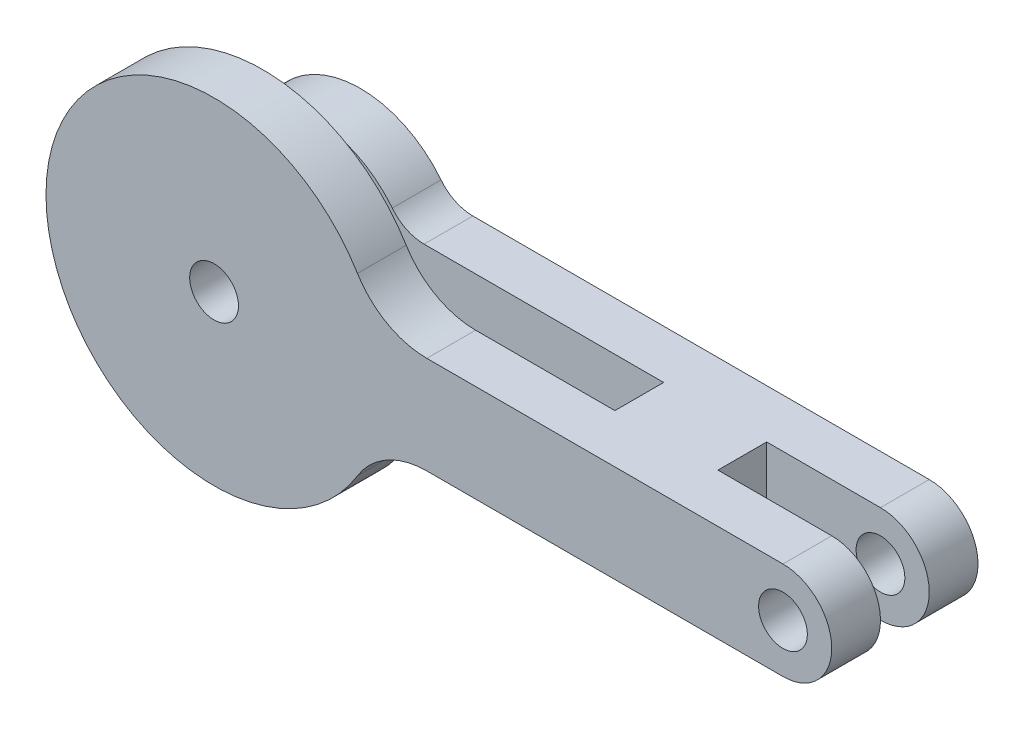
ISO-10303-21;
HEADER;
FILE_DESCRIPTION(('STEP AP214'),'2;1');
FILE_NAME('part.step','',(''),(''),'','','');
FILE_SCHEMA(('AUTOMOTIVE_DESIGN { 1 0 10303 214 1 1 1 1 }'));
ENDSEC;
DATA;
#1=APPLICATION_CONTEXT('core data for automotive mechanical design processes');
#2=APPLICATION_PROTOCOL_DEFINITION('international standard','automotive_design',2000,#1);
#3=PRODUCT_CONTEXT('',#1,'mechanical');
#4=PRODUCT('Part','Part','',(#3));
#5=PRODUCT_RELATED_PRODUCT_CATEGORY('part','',(#4));
#6=PRODUCT_DEFINITION_FORMATION('','',#4);
#7=PRODUCT_DEFINITION_CONTEXT('part definition',#1,'design');
#8=PRODUCT_DEFINITION('design','',#6,#7);
#9=PRODUCT_DEFINITION_SHAPE('','',#8);
#10=(LENGTH_UNIT() NAMED_UNIT(*) SI_UNIT(.MILLI.,.METRE.));
#11=(NAMED_UNIT(*) PLANE_ANGLE_UNIT() SI_UNIT($,.RADIAN.));
#12=(NAMED_UNIT(*) SI_UNIT($,.STERADIAN.) SOLID_ANGLE_UNIT());
#13=UNCERTAINTY_MEASURE_WITH_UNIT(LENGTH_MEASURE(1.E-05),#10,'distance_accuracy_value','');
#14=(GEOMETRIC_REPRESENTATION_CONTEXT(3) GLOBAL_UNCERTAINTY_ASSIGNED_CONTEXT((#13)) GLOBAL_UNIT_ASSIGNED_CONTEXT((#10,
#11,#12)) REPRESENTATION_CONTEXT('',''));
#15=CARTESIAN_POINT('',(0.,0.,0.));
#16=DIRECTION('',(0.,0.,1.));
#17=DIRECTION('',(1.,0.,0.));
#18=AXIS2_PLACEMENT_3D('',#15,#16,#17);
#19=CARTESIAN_POINT('',(0.,0.,-4.5));
#20=DIRECTION('',(0.,0.,1.));
#21=DIRECTION('',(1.,0.,0.));
#22=AXIS2_PLACEMENT_3D('',#19,#20,#21);
#23=PLANE('',#22);
#24=CARTESIAN_POINT('',(0.,0.,-4.5));
#25=DIRECTION('',(0.,0.,1.));
#26=DIRECTION('',(1.,0.,0.));
#27=AXIS2_PLACEMENT_3D('',#24,#25,#26);
#28=CIRCLE('',#27,1.5);
#29=CARTESIAN_POINT('',(1.5,0.,-4.5));
#30=VERTEX_POINT('',#29);
#31=EDGE_CURVE('E245',#30,#30,#28,.T.);
#32=ORIENTED_EDGE('',*,*,#31,.T.);
#33=EDGE_LOOP('',(#32));
#34=FACE_BOUND('',#33,.T.);
#35=CARTESIAN_POINT('',(35.,0.,-4.5));
#36=DIRECTION('',(0.,0.,1.));
#37=DIRECTION('',(1.,0.,0.));
#38=AXIS2_PLACEMENT_3D('',#35,#36,#37);
#39=CIRCLE('',#38,1.5);
#40=CARTESIAN_POINT('',(36.5,0.,-4.5));
#41=VERTEX_POINT('',#40);
#42=EDGE_CURVE('E242',#41,#41,#39,.T.);
#43=ORIENTED_EDGE('',*,*,#42,.T.);
#44=EDGE_LOOP('',(#43));
#45=FACE_BOUND('',#44,.T.);
#46=DIRECTION('',(1.,0.,0.));
#47=VECTOR('',#46,1.);
#48=CARTESIAN_POINT('',(0.,-3.,-4.5));
#49=LINE('',#48,#47);
#50=CARTESIAN_POINT('',(6.92066470795978,-3.,-4.5));
#51=VERTEX_POINT('',#50);
#52=CARTESIAN_POINT('',(35.,-3.,-4.5));
#53=VERTEX_POINT('',#52);
#54=EDGE_CURVE('E237',#51,#53,#49,.T.);
#55=ORIENTED_EDGE('',*,*,#54,.F.);
#56=CARTESIAN_POINT('',(6.92066470795978,-5.5,-4.5));
#57=DIRECTION('',(0.,0.,1.));
#58=DIRECTION('',(1.,0.,0.));
#59=AXIS2_PLACEMENT_3D('',#56,#57,#58);
#60=CIRCLE('',#59,2.5);
#61=CARTESIAN_POINT('',(4.96346315027885,-3.94457013574661,-4.5));
#62=VERTEX_POINT('',#61);
#63=EDGE_CURVE('E47',#51,#62,#60,.T.);
#64=ORIENTED_EDGE('',*,*,#63,.T.);
#65=CARTESIAN_POINT('',(0.,0.,-4.5));
#66=DIRECTION('',(0.,0.,1.));
#67=DIRECTION('',(1.,0.,0.));
#68=AXIS2_PLACEMENT_3D('',#65,#66,#67);
#69=CIRCLE('',#68,6.34);
#70=CARTESIAN_POINT('',(4.96346315027885,3.94457013574661,-4.5));
#71=VERTEX_POINT('',#70);
#72=EDGE_CURVE('E179',#71,#62,#69,.T.);
#73=ORIENTED_EDGE('',*,*,#72,.F.);
#74=CARTESIAN_POINT('',(6.92066470795978,5.5,-4.5));
#75=DIRECTION('',(0.,0.,1.));
#76=DIRECTION('',(1.,0.,0.));
#77=AXIS2_PLACEMENT_3D('',#74,#75,#76);
#78=CIRCLE('',#77,2.5);
#79=CARTESIAN_POINT('',(6.92066470795978,3.,-4.5));
#80=VERTEX_POINT('',#79);
#81=EDGE_CURVE('E289',#71,#80,#78,.T.);
#82=ORIENTED_EDGE('',*,*,#81,.T.);
#83=DIRECTION('',(1.,0.,0.));
#84=VECTOR('',#83,1.);
#85=CARTESIAN_POINT('',(0.,3.,-4.5));
#86=LINE('',#85,#84);
#87=CARTESIAN_POINT('',(35.,3.,-4.5));
#88=VERTEX_POINT('',#87);
#89=EDGE_CURVE('E235',#80,#88,#86,.T.);
#90=ORIENTED_EDGE('',*,*,#89,.T.);
#91=CARTESIAN_POINT('',(35.,0.,-4.5));
#92=DIRECTION('',(0.,0.,1.));
#93=DIRECTION('',(1.,0.,0.));
#94=AXIS2_PLACEMENT_3D('',#91,#92,#93);
#95=CIRCLE('',#94,3.);
#96=EDGE_CURVE('E239',#53,#88,#95,.T.);
#97=ORIENTED_EDGE('',*,*,#96,.F.);
#98=EDGE_LOOP('',(#55,#64,#73,#82,#90,#97));
#99=FACE_BOUND('',#98,.T.);
#100=ADVANCED_FACE('F39',(#34,#45,#99),#23,.F.);
#101=CARTESIAN_POINT('',(21.66,-15.2776614173109,-1.5));
#102=DIRECTION('',(0.,0.,1.));
#103=DIRECTION('',(1.,0.,0.));
#104=AXIS2_PLACEMENT_3D('',#101,#102,#103);
#105=PLANE('',#104);
#106=CARTESIAN_POINT('',(0.,0.,-1.5));
#107=DIRECTION('',(0.,0.,1.));
#108=DIRECTION('',(1.,0.,0.));
#109=AXIS2_PLACEMENT_3D('',#106,#107,#108);
#110=CIRCLE('',#109,1.5);
#111=CARTESIAN_POINT('',(1.5,0.,-1.5));
#112=VERTEX_POINT('',#111);
#113=EDGE_CURVE('E192',#112,#112,#110,.F.);
#114=ORIENTED_EDGE('',*,*,#113,.T.);
#115=EDGE_LOOP('',(#114));
#116=FACE_BOUND('',#115,.T.);
#117=CARTESIAN_POINT('',(0.,0.,-1.5));
#118=DIRECTION('',(0.,0.,1.));
#119=DIRECTION('',(1.,0.,0.));
#120=AXIS2_PLACEMENT_3D('',#117,#118,#119);
#121=CIRCLE('',#120,6.34);
#122=CARTESIAN_POINT('',(4.96346315027885,-3.94457013574661,-1.5));
#123=VERTEX_POINT('',#122);
#124=CARTESIAN_POINT('',(4.96346315027885,3.94457013574661,-1.5));
#125=VERTEX_POINT('',#124);
#126=EDGE_CURVE('E265',#123,#125,#121,.F.);
#127=ORIENTED_EDGE('',*,*,#126,.F.);
#128=CARTESIAN_POINT('',(6.92066470795978,-5.5,-1.5));
#129=DIRECTION('',(0.,0.,1.));
#130=DIRECTION('',(1.,0.,0.));
#131=AXIS2_PLACEMENT_3D('',#128,#129,#130);
#132=CIRCLE('',#131,2.5);
#133=CARTESIAN_POINT('',(6.92066470795978,-3.,-1.5));
#134=VERTEX_POINT('',#133);
#135=EDGE_CURVE('E11',#123,#134,#132,.F.);
#136=ORIENTED_EDGE('',*,*,#135,.T.);
#137=DIRECTION('',(-1.,0.,0.));
#138=VECTOR('',#137,1.);
#139=CARTESIAN_POINT('',(0.,-3.,-1.5));
#140=LINE('',#139,#138);
#141=CARTESIAN_POINT('',(21.66,-3.,-1.5));
#142=VERTEX_POINT('',#141);
#143=EDGE_CURVE('E193',#142,#134,#140,.T.);
#144=ORIENTED_EDGE('',*,*,#143,.F.);
#145=DIRECTION('',(0.,1.,0.));
#146=VECTOR('',#145,1.);
#147=CARTESIAN_POINT('',(21.66,-15.2776614173109,-1.5));
#148=LINE('',#147,#146);
#149=CARTESIAN_POINT('',(21.66,3.,-1.5));
#150=VERTEX_POINT('',#149);
#151=EDGE_CURVE('E172',#142,#150,#148,.T.);
#152=ORIENTED_EDGE('',*,*,#151,.T.);
#153=DIRECTION('',(-1.,0.,0.));
#154=VECTOR('',#153,1.);
#155=CARTESIAN_POINT('',(0.,3.,-1.5));
#156=LINE('',#155,#154);
#157=CARTESIAN_POINT('',(6.92066470795978,3.,-1.5));
#158=VERTEX_POINT('',#157);
#159=EDGE_CURVE('E195',#150,#158,#156,.T.);
#160=ORIENTED_EDGE('',*,*,#159,.T.);
#161=CARTESIAN_POINT('',(6.92066470795978,5.5,-1.5));
#162=DIRECTION('',(0.,0.,1.));
#163=DIRECTION('',(1.,0.,0.));
#164=AXIS2_PLACEMENT_3D('',#161,#162,#163);
#165=CIRCLE('',#164,2.5);
#166=EDGE_CURVE('E291',#158,#125,#165,.F.);
#167=ORIENTED_EDGE('',*,*,#166,.T.);
#168=EDGE_LOOP('',(#127,#136,#144,#152,#160,#167));
#169=FACE_BOUND('',#168,.T.);
#170=ADVANCED_FACE('F346',(#116,#169),#105,.T.);
#171=CARTESIAN_POINT('',(0.,3.,-4.5));
#172=DIRECTION('',(0.,-1.,0.));
#173=DIRECTION('',(0.,0.,-1.));
#174=AXIS2_PLACEMENT_3D('',#171,#172,#173);
#175=PLANE('',#174);
#176=ORIENTED_EDGE('',*,*,#89,.F.);
#177=DIRECTION('',(0.,0.,1.));
#178=VECTOR('',#177,1.);
#179=CARTESIAN_POINT('',(6.92066470795978,3.,-1.5));
#180=LINE('',#179,#178);
#181=EDGE_CURVE('E287',#80,#158,#180,.T.);
#182=ORIENTED_EDGE('',*,*,#181,.T.);
#183=ORIENTED_EDGE('',*,*,#159,.F.);
#184=DIRECTION('',(0.,0.,-1.));
#185=VECTOR('',#184,1.);
#186=CARTESIAN_POINT('',(21.66,3.,-4.5));
#187=LINE('',#186,#185);
#188=CARTESIAN_POINT('',(21.66,3.,1.5));
#189=VERTEX_POINT('',#188);
#190=EDGE_CURVE('E215',#189,#150,#187,.T.);
#191=ORIENTED_EDGE('',*,*,#190,.F.);
#192=DIRECTION('',(1.,0.,0.));
#193=VECTOR('',#192,1.);
#194=CARTESIAN_POINT('',(0.,3.,1.5));
#195=LINE('',#194,#193);
#196=CARTESIAN_POINT('',(13.0887585354762,3.,1.5));
#197=VERTEX_POINT('',#196);
#198=EDGE_CURVE('E162',#197,#189,#195,.T.);
#199=ORIENTED_EDGE('',*,*,#198,.F.);
#200=DIRECTION('',(0.,0.,1.));
#201=VECTOR('',#200,1.);
#202=CARTESIAN_POINT('',(13.0887585354762,3.,-4.5));
#203=LINE('',#202,#201);
#204=CARTESIAN_POINT('',(13.0887585354762,3.,4.5));
#205=VERTEX_POINT('',#204);
#206=EDGE_CURVE('E267',#197,#205,#203,.T.);
#207=ORIENTED_EDGE('',*,*,#206,.T.);
#208=DIRECTION('',(1.,0.,0.));
#209=VECTOR('',#208,1.);
#210=CARTESIAN_POINT('',(0.,3.,4.5));
#211=LINE('',#210,#209);
#212=CARTESIAN_POINT('',(35.,3.,4.5));
#213=VERTEX_POINT('',#212);
#214=EDGE_CURVE('E219',#205,#213,#211,.T.);
#215=ORIENTED_EDGE('',*,*,#214,.T.);
#216=DIRECTION('',(0.,0.,1.));
#217=VECTOR('',#216,1.);
#218=CARTESIAN_POINT('',(35.,3.,-4.5));
#219=LINE('',#218,#217);
#220=CARTESIAN_POINT('',(35.,3.,1.5));
#221=VERTEX_POINT('',#220);
#222=EDGE_CURVE('E251',#221,#213,#219,.T.);
#223=ORIENTED_EDGE('',*,*,#222,.F.);
#224=DIRECTION('',(1.,0.,0.));
#225=VECTOR('',#224,1.);
#226=CARTESIAN_POINT('',(0.,3.,1.5));
#227=LINE('',#226,#225);
#228=CARTESIAN_POINT('',(28.,3.,1.5));
#229=VERTEX_POINT('',#228);
#230=EDGE_CURVE('E212',#229,#221,#227,.T.);
#231=ORIENTED_EDGE('',*,*,#230,.F.);
#232=DIRECTION('',(0.,0.,1.));
#233=VECTOR('',#232,1.);
#234=CARTESIAN_POINT('',(28.,3.,-4.5));
#235=LINE('',#234,#233);
#236=CARTESIAN_POINT('',(28.,3.,-1.5));
#237=VERTEX_POINT('',#236);
#238=EDGE_CURVE('E217',#237,#229,#235,.T.);
#239=ORIENTED_EDGE('',*,*,#238,.F.);
#240=DIRECTION('',(-1.,0.,0.));
#241=VECTOR('',#240,1.);
#242=CARTESIAN_POINT('',(0.,3.,-1.5));
#243=LINE('',#242,#241);
#244=CARTESIAN_POINT('',(35.,3.,-1.5));
#245=VERTEX_POINT('',#244);
#246=EDGE_CURVE('E204',#245,#237,#243,.T.);
#247=ORIENTED_EDGE('',*,*,#246,.F.);
#248=EDGE_CURVE('E174',#88,#245,#219,.T.);
#249=ORIENTED_EDGE('',*,*,#248,.F.);
#250=EDGE_LOOP('',(#176,#182,#183,#191,#199,#207,#215,#223,#231,#239,#247,#249));
#251=FACE_BOUND('',#250,.T.);
#252=ADVANCED_FACE('F322',(#251),#175,.F.);
#253=CARTESIAN_POINT('',(35.,0.,-4.5));
#254=DIRECTION('',(0.,0.,1.));
#255=DIRECTION('',(1.,0.,0.));
#256=AXIS2_PLACEMENT_3D('',#253,#254,#255);
#257=CYLINDRICAL_SURFACE('',#256,3.);
#258=CARTESIAN_POINT('',(35.,0.,1.5));
#259=DIRECTION('',(0.,0.,-1.));
#260=DIRECTION('',(-1.,0.,0.));
#261=AXIS2_PLACEMENT_3D('',#258,#259,#260);
#262=CIRCLE('',#261,3.);
#263=CARTESIAN_POINT('',(35.,-3.,1.5));
#264=VERTEX_POINT('',#263);
#265=EDGE_CURVE('E210',#264,#221,#262,.F.);
#266=ORIENTED_EDGE('',*,*,#265,.T.);
#267=ORIENTED_EDGE('',*,*,#222,.T.);
#268=CARTESIAN_POINT('',(35.,0.,4.5));
#269=DIRECTION('',(0.,0.,1.));
#270=DIRECTION('',(1.,0.,0.));
#271=AXIS2_PLACEMENT_3D('',#268,#269,#270);
#272=CIRCLE('',#271,3.);
#273=CARTESIAN_POINT('',(35.,-3.,4.5));
#274=VERTEX_POINT('',#273);
#275=EDGE_CURVE('E226',#274,#213,#272,.T.);
#276=ORIENTED_EDGE('',*,*,#275,.F.);
#277=DIRECTION('',(0.,0.,1.));
#278=VECTOR('',#277,1.);
#279=CARTESIAN_POINT('',(35.,-3.,-4.5));
#280=LINE('',#279,#278);
#281=EDGE_CURVE('E248',#264,#274,#280,.T.);
#282=ORIENTED_EDGE('',*,*,#281,.F.);
#283=EDGE_LOOP('',(#266,#267,#276,#282));
#284=FACE_BOUND('',#283,.T.);
#285=ADVANCED_FACE('F327',(#284),#257,.T.);
#286=CARTESIAN_POINT('',(35.,0.,-1.5));
#287=DIRECTION('',(0.,0.,1.));
#288=DIRECTION('',(1.,0.,0.));
#289=AXIS2_PLACEMENT_3D('',#286,#287,#288);
#290=CIRCLE('',#289,3.);
#291=CARTESIAN_POINT('',(35.,-3.,-1.5));
#292=VERTEX_POINT('',#291);
#293=EDGE_CURVE('E202',#245,#292,#290,.F.);
#294=ORIENTED_EDGE('',*,*,#293,.T.);
#295=EDGE_CURVE('E252',#53,#292,#280,.T.);
#296=ORIENTED_EDGE('',*,*,#295,.F.);
#297=ORIENTED_EDGE('',*,*,#96,.T.);
#298=ORIENTED_EDGE('',*,*,#248,.T.);
#299=EDGE_LOOP('',(#294,#296,#297,#298));
#300=FACE_BOUND('',#299,.T.);
#301=ADVANCED_FACE('F305',(#300),#257,.T.);
#302=CARTESIAN_POINT('',(0.,-3.,-4.5));
#303=DIRECTION('',(0.,-1.,0.));
#304=DIRECTION('',(0.,0.,-1.));
#305=AXIS2_PLACEMENT_3D('',#302,#303,#304);
#306=PLANE('',#305);
#307=ORIENTED_EDGE('',*,*,#143,.T.);
#308=DIRECTION('',(0.,0.,-1.));
#309=VECTOR('',#308,1.);
#310=CARTESIAN_POINT('',(6.92066470795978,-3.,-4.5));
#311=LINE('',#310,#309);
#312=EDGE_CURVE('E294',#134,#51,#311,.T.);
#313=ORIENTED_EDGE('',*,*,#312,.T.);
#314=ORIENTED_EDGE('',*,*,#54,.T.);
#315=ORIENTED_EDGE('',*,*,#295,.T.);
#316=DIRECTION('',(-1.,0.,0.));
#317=VECTOR('',#316,1.);
#318=CARTESIAN_POINT('',(0.,-3.,-1.5));
#319=LINE('',#318,#317);
#320=CARTESIAN_POINT('',(28.,-3.,-1.5));
#321=VERTEX_POINT('',#320);
#322=EDGE_CURVE('E199',#292,#321,#319,.T.);
#323=ORIENTED_EDGE('',*,*,#322,.T.);
#324=DIRECTION('',(0.,0.,1.));
#325=VECTOR('',#324,1.);
#326=CARTESIAN_POINT('',(28.,-3.,-4.5));
#327=LINE('',#326,#325);
#328=CARTESIAN_POINT('',(28.,-3.,1.5));
#329=VERTEX_POINT('',#328);
#330=EDGE_CURVE('E173',#321,#329,#327,.T.);
#331=ORIENTED_EDGE('',*,*,#330,.T.);
#332=DIRECTION('',(1.,0.,0.));
#333=VECTOR('',#332,1.);
#334=CARTESIAN_POINT('',(0.,-3.,1.5));
#335=LINE('',#334,#333);
#336=EDGE_CURVE('E207',#329,#264,#335,.T.);
#337=ORIENTED_EDGE('',*,*,#336,.T.);
#338=ORIENTED_EDGE('',*,*,#281,.T.);
#339=DIRECTION('',(1.,0.,0.));
#340=VECTOR('',#339,1.);
#341=CARTESIAN_POINT('',(0.,-3.,4.5));
#342=LINE('',#341,#340);
#343=CARTESIAN_POINT('',(13.0887585354762,-3.,4.5));
#344=VERTEX_POINT('',#343);
#345=EDGE_CURVE('E224',#344,#274,#342,.T.);
#346=ORIENTED_EDGE('',*,*,#345,.F.);
#347=DIRECTION('',(0.,0.,-1.));
#348=VECTOR('',#347,1.);
#349=CARTESIAN_POINT('',(13.0887585354762,-3.,1.5));
#350=LINE('',#349,#348);
#351=CARTESIAN_POINT('',(13.0887585354762,-3.,1.5));
#352=VERTEX_POINT('',#351);
#353=EDGE_CURVE('E158',#344,#352,#350,.T.);
#354=ORIENTED_EDGE('',*,*,#353,.T.);
#355=DIRECTION('',(1.,0.,0.));
#356=VECTOR('',#355,1.);
#357=CARTESIAN_POINT('',(0.,-3.,1.5));
#358=LINE('',#357,#356);
#359=CARTESIAN_POINT('',(21.66,-3.,1.5));
#360=VERTEX_POINT('',#359);
#361=EDGE_CURVE('E151',#352,#360,#358,.T.);
#362=ORIENTED_EDGE('',*,*,#361,.T.);
#363=DIRECTION('',(0.,0.,-1.));
#364=VECTOR('',#363,1.);
#365=CARTESIAN_POINT('',(21.66,-3.,-4.5));
#366=LINE('',#365,#364);
#367=EDGE_CURVE('E155',#360,#142,#366,.T.);
#368=ORIENTED_EDGE('',*,*,#367,.T.);
#369=EDGE_LOOP('',(#307,#313,#314,#315,#323,#331,#337,#338,#346,#354,#362,#368));
#370=FACE_BOUND('',#369,.T.);
#371=ADVANCED_FACE('F154',(#370),#306,.T.);
#372=CARTESIAN_POINT('',(35.,0.,-4.5));
#373=DIRECTION('',(0.,0.,1.));
#374=DIRECTION('',(1.,0.,0.));
#375=AXIS2_PLACEMENT_3D('',#372,#373,#374);
#376=CYLINDRICAL_SURFACE('',#375,1.5);
#377=CARTESIAN_POINT('',(35.,0.,4.5));
#378=DIRECTION('',(0.,0.,1.));
#379=DIRECTION('',(1.,0.,0.));
#380=AXIS2_PLACEMENT_3D('',#377,#378,#379);
#381=CIRCLE('',#380,1.5);
#382=CARTESIAN_POINT('',(36.5,0.,4.5));
#383=VERTEX_POINT('',#382);
#384=EDGE_CURVE('E229',#383,#383,#381,.T.);
#385=ORIENTED_EDGE('',*,*,#384,.T.);
#386=EDGE_LOOP('',(#385));
#387=FACE_BOUND('',#386,.T.);
#388=CARTESIAN_POINT('',(35.,0.,1.5));
#389=DIRECTION('',(0.,0.,-1.));
#390=DIRECTION('',(-1.,0.,0.));
#391=AXIS2_PLACEMENT_3D('',#388,#389,#390);
#392=CIRCLE('',#391,1.5);
#393=CARTESIAN_POINT('',(33.5,0.,1.5));
#394=VERTEX_POINT('',#393);
#395=EDGE_CURVE('E206',#394,#394,#392,.F.);
#396=ORIENTED_EDGE('',*,*,#395,.F.);
#397=EDGE_LOOP('',(#396));
#398=FACE_BOUND('',#397,.T.);
#399=ADVANCED_FACE('F370',(#387,#398),#376,.F.);
#400=ORIENTED_EDGE('',*,*,#42,.F.);
#401=EDGE_LOOP('',(#400));
#402=FACE_BOUND('',#401,.T.);
#403=CARTESIAN_POINT('',(35.,0.,-1.5));
#404=DIRECTION('',(0.,0.,1.));
#405=DIRECTION('',(1.,0.,0.));
#406=AXIS2_PLACEMENT_3D('',#403,#404,#405);
#407=CIRCLE('',#406,1.5);
#408=CARTESIAN_POINT('',(36.5,0.,-1.5));
#409=VERTEX_POINT('',#408);
#410=EDGE_CURVE('E198',#409,#409,#407,.F.);
#411=ORIENTED_EDGE('',*,*,#410,.F.);
#412=EDGE_LOOP('',(#411));
#413=FACE_BOUND('',#412,.T.);
#414=ADVANCED_FACE('F373',(#402,#413),#376,.F.);
#415=CARTESIAN_POINT('',(0.,0.,-4.5));
#416=DIRECTION('',(0.,0.,1.));
#417=DIRECTION('',(1.,0.,0.));
#418=AXIS2_PLACEMENT_3D('',#415,#416,#417);
#419=CYLINDRICAL_SURFACE('',#418,10.34);
#420=CARTESIAN_POINT('',(0.,0.,1.5));
#421=DIRECTION('',(0.,0.,-1.));
#422=DIRECTION('',(-1.,0.,0.));
#423=AXIS2_PLACEMENT_3D('',#420,#421,#422);
#424=CIRCLE('',#423,10.34);
#425=CARTESIAN_POINT('',(8.82253997762865,5.39243807040417,1.5));
#426=VERTEX_POINT('',#425);
#427=CARTESIAN_POINT('',(8.82253997762865,-5.39243807040417,1.5));
#428=VERTEX_POINT('',#427);
#429=EDGE_CURVE('E163',#426,#428,#424,.F.);
#430=ORIENTED_EDGE('',*,*,#429,.T.);
#431=DIRECTION('',(0.,0.,1.));
#432=VECTOR('',#431,1.);
#433=CARTESIAN_POINT('',(8.82253997762865,-5.39243807040417,-4.5));
#434=LINE('',#433,#432);
#435=CARTESIAN_POINT('',(8.82253997762865,-5.39243807040417,4.5));
#436=VERTEX_POINT('',#435);
#437=EDGE_CURVE('E276',#428,#436,#434,.T.);
#438=ORIENTED_EDGE('',*,*,#437,.T.);
#439=CARTESIAN_POINT('',(0.,0.,4.5));
#440=DIRECTION('',(0.,0.,1.));
#441=DIRECTION('',(1.,0.,0.));
#442=AXIS2_PLACEMENT_3D('',#439,#440,#441);
#443=CIRCLE('',#442,10.34);
#444=CARTESIAN_POINT('',(8.82253997762865,5.39243807040417,4.5));
#445=VERTEX_POINT('',#444);
#446=EDGE_CURVE('E221',#445,#436,#443,.T.);
#447=ORIENTED_EDGE('',*,*,#446,.F.);
#448=DIRECTION('',(0.,0.,1.));
#449=VECTOR('',#448,1.);
#450=CARTESIAN_POINT('',(8.82253997762865,5.39243807040417,-4.5));
#451=LINE('',#450,#449);
#452=EDGE_CURVE('E270',#445,#426,#451,.F.);
#453=ORIENTED_EDGE('',*,*,#452,.T.);
#454=EDGE_LOOP('',(#430,#438,#447,#453));
#455=FACE_BOUND('',#454,.T.);
#456=ADVANCED_FACE('F338',(#455),#419,.T.);
#457=CARTESIAN_POINT('',(0.,0.,-4.5));
#458=DIRECTION('',(0.,0.,1.));
#459=DIRECTION('',(1.,0.,0.));
#460=AXIS2_PLACEMENT_3D('',#457,#458,#459);
#461=CYLINDRICAL_SURFACE('',#460,1.5);
#462=ORIENTED_EDGE('',*,*,#31,.F.);
#463=EDGE_LOOP('',(#462));
#464=FACE_BOUND('',#463,.T.);
#465=ORIENTED_EDGE('',*,*,#113,.F.);
#466=EDGE_LOOP('',(#465));
#467=FACE_BOUND('',#466,.T.);
#468=ADVANCED_FACE('F365',(#464,#467),#461,.F.);
#469=CARTESIAN_POINT('',(0.,0.,4.5));
#470=DIRECTION('',(0.,0.,1.));
#471=DIRECTION('',(1.,0.,0.));
#472=AXIS2_PLACEMENT_3D('',#469,#470,#471);
#473=CIRCLE('',#472,1.5);
#474=CARTESIAN_POINT('',(1.5,0.,4.5));
#475=VERTEX_POINT('',#474);
#476=EDGE_CURVE('E232',#475,#475,#473,.T.);
#477=ORIENTED_EDGE('',*,*,#476,.T.);
#478=EDGE_LOOP('',(#477));
#479=FACE_BOUND('',#478,.T.);
#480=CARTESIAN_POINT('',(0.,0.,1.5));
#481=DIRECTION('',(0.,0.,-1.));
#482=DIRECTION('',(-1.,0.,0.));
#483=AXIS2_PLACEMENT_3D('',#480,#481,#482);
#484=CIRCLE('',#483,1.5);
#485=CARTESIAN_POINT('',(-1.5,0.,1.5));
#486=VERTEX_POINT('',#485);
#487=EDGE_CURVE('E189',#486,#486,#484,.F.);
#488=ORIENTED_EDGE('',*,*,#487,.F.);
#489=EDGE_LOOP('',(#488));
#490=FACE_BOUND('',#489,.T.);
#491=ADVANCED_FACE('F368',(#479,#490),#461,.F.);
#492=CARTESIAN_POINT('',(0.,0.,4.5));
#493=DIRECTION('',(0.,0.,1.));
#494=DIRECTION('',(1.,0.,0.));
#495=AXIS2_PLACEMENT_3D('',#492,#493,#494);
#496=PLANE('',#495);
#497=ORIENTED_EDGE('',*,*,#214,.F.);
#498=CARTESIAN_POINT('',(13.0887585354762,8.,4.5));
#499=DIRECTION('',(0.,0.,1.));
#500=DIRECTION('',(1.,0.,0.));
#501=AXIS2_PLACEMENT_3D('',#498,#499,#500);
#502=CIRCLE('',#501,5.);
#503=EDGE_CURVE('E272',#205,#445,#502,.F.);
#504=ORIENTED_EDGE('',*,*,#503,.T.);
#505=ORIENTED_EDGE('',*,*,#446,.T.);
#506=CARTESIAN_POINT('',(13.0887585354762,-8.,4.5));
#507=DIRECTION('',(0.,0.,1.));
#508=DIRECTION('',(1.,0.,0.));
#509=AXIS2_PLACEMENT_3D('',#506,#507,#508);
#510=CIRCLE('',#509,5.);
#511=EDGE_CURVE('E280',#436,#344,#510,.F.);
#512=ORIENTED_EDGE('',*,*,#511,.T.);
#513=ORIENTED_EDGE('',*,*,#345,.T.);
#514=ORIENTED_EDGE('',*,*,#275,.T.);
#515=EDGE_LOOP('',(#497,#504,#505,#512,#513,#514));
#516=FACE_BOUND('',#515,.T.);
#517=ORIENTED_EDGE('',*,*,#384,.F.);
#518=EDGE_LOOP('',(#517));
#519=FACE_BOUND('',#518,.T.);
#520=ORIENTED_EDGE('',*,*,#476,.F.);
#521=EDGE_LOOP('',(#520));
#522=FACE_BOUND('',#521,.T.);
#523=ADVANCED_FACE('F330',(#516,#519,#522),#496,.T.);
#524=CARTESIAN_POINT('',(21.66,-15.2776614173109,1.5));
#525=DIRECTION('',(-1.,0.,0.));
#526=DIRECTION('',(0.,-1.,0.));
#527=AXIS2_PLACEMENT_3D('',#524,#525,#526);
#528=PLANE('',#527);
#529=ORIENTED_EDGE('',*,*,#190,.T.);
#530=ORIENTED_EDGE('',*,*,#151,.F.);
#531=ORIENTED_EDGE('',*,*,#367,.F.);
#532=DIRECTION('',(0.,1.,0.));
#533=VECTOR('',#532,1.);
#534=CARTESIAN_POINT('',(21.66,-15.2776614173109,1.5));
#535=LINE('',#534,#533);
#536=EDGE_CURVE('E169',#360,#189,#535,.T.);
#537=ORIENTED_EDGE('',*,*,#536,.T.);
#538=EDGE_LOOP('',(#529,#530,#531,#537));
#539=FACE_BOUND('',#538,.T.);
#540=ADVANCED_FACE('F168',(#539),#528,.T.);
#541=CARTESIAN_POINT('',(-10.34,-15.2776614173109,1.5));
#542=DIRECTION('',(0.,0.,-1.));
#543=DIRECTION('',(-1.,0.,0.));
#544=AXIS2_PLACEMENT_3D('',#541,#542,#543);
#545=PLANE('',#544);
#546=ORIENTED_EDGE('',*,*,#487,.T.);
#547=EDGE_LOOP('',(#546));
#548=FACE_BOUND('',#547,.T.);
#549=ORIENTED_EDGE('',*,*,#429,.F.);
#550=CARTESIAN_POINT('',(13.0887585354762,8.,1.5));
#551=DIRECTION('',(0.,0.,-1.));
#552=DIRECTION('',(-1.,0.,0.));
#553=AXIS2_PLACEMENT_3D('',#550,#551,#552);
#554=CIRCLE('',#553,5.);
#555=EDGE_CURVE('E274',#426,#197,#554,.F.);
#556=ORIENTED_EDGE('',*,*,#555,.T.);
#557=ORIENTED_EDGE('',*,*,#198,.T.);
#558=ORIENTED_EDGE('',*,*,#536,.F.);
#559=ORIENTED_EDGE('',*,*,#361,.F.);
#560=CARTESIAN_POINT('',(13.0887585354762,-8.,1.5));
#561=DIRECTION('',(0.,0.,-1.));
#562=DIRECTION('',(-1.,0.,0.));
#563=AXIS2_PLACEMENT_3D('',#560,#561,#562);
#564=CIRCLE('',#563,5.);
#565=EDGE_CURVE('E282',#352,#428,#564,.F.);
#566=ORIENTED_EDGE('',*,*,#565,.T.);
#567=EDGE_LOOP('',(#549,#556,#557,#558,#559,#566));
#568=FACE_BOUND('',#567,.T.);
#569=ADVANCED_FACE('F177',(#548,#568),#545,.T.);
#570=CARTESIAN_POINT('',(28.,-15.2776614173109,-1.5));
#571=DIRECTION('',(1.,0.,0.));
#572=DIRECTION('',(0.,1.,0.));
#573=AXIS2_PLACEMENT_3D('',#570,#571,#572);
#574=PLANE('',#573);
#575=ORIENTED_EDGE('',*,*,#238,.T.);
#576=DIRECTION('',(0.,1.,0.));
#577=VECTOR('',#576,1.);
#578=CARTESIAN_POINT('',(28.,-15.2776614173109,1.5));
#579=LINE('',#578,#577);
#580=EDGE_CURVE('E185',#329,#229,#579,.T.);
#581=ORIENTED_EDGE('',*,*,#580,.F.);
#582=ORIENTED_EDGE('',*,*,#330,.F.);
#583=DIRECTION('',(0.,1.,0.));
#584=VECTOR('',#583,1.);
#585=CARTESIAN_POINT('',(28.,-15.2776614173109,-1.5));
#586=LINE('',#585,#584);
#587=EDGE_CURVE('E181',#321,#237,#586,.T.);
#588=ORIENTED_EDGE('',*,*,#587,.T.);
#589=EDGE_LOOP('',(#575,#581,#582,#588));
#590=FACE_BOUND('',#589,.T.);
#591=ADVANCED_FACE('F315',(#590),#574,.T.);
#592=CARTESIAN_POINT('',(28.,-15.2776614173109,1.5));
#593=DIRECTION('',(0.,0.,-1.));
#594=DIRECTION('',(-1.,0.,0.));
#595=AXIS2_PLACEMENT_3D('',#592,#593,#594);
#596=PLANE('',#595);
#597=ORIENTED_EDGE('',*,*,#395,.T.);
#598=EDGE_LOOP('',(#597));
#599=FACE_BOUND('',#598,.T.);
#600=ORIENTED_EDGE('',*,*,#230,.T.);
#601=ORIENTED_EDGE('',*,*,#265,.F.);
#602=ORIENTED_EDGE('',*,*,#336,.F.);
#603=ORIENTED_EDGE('',*,*,#580,.T.);
#604=EDGE_LOOP('',(#600,#601,#602,#603));
#605=FACE_BOUND('',#604,.T.);
#606=ADVANCED_FACE('F319',(#599,#605),#596,.T.);
#607=CARTESIAN_POINT('',(38.,-15.2776614173109,-1.5));
#608=DIRECTION('',(0.,0.,1.));
#609=DIRECTION('',(1.,0.,0.));
#610=AXIS2_PLACEMENT_3D('',#607,#608,#609);
#611=PLANE('',#610);
#612=ORIENTED_EDGE('',*,*,#410,.T.);
#613=EDGE_LOOP('',(#612));
#614=FACE_BOUND('',#613,.T.);
#615=ORIENTED_EDGE('',*,*,#246,.T.);
#616=ORIENTED_EDGE('',*,*,#587,.F.);
#617=ORIENTED_EDGE('',*,*,#322,.F.);
#618=ORIENTED_EDGE('',*,*,#293,.F.);
#619=EDGE_LOOP('',(#615,#616,#617,#618));
#620=FACE_BOUND('',#619,.T.);
#621=ADVANCED_FACE('F309',(#614,#620),#611,.T.);
#622=CARTESIAN_POINT('',(0.,0.,-0.999999999999999));
#623=DIRECTION('',(0.,0.,-1.));
#624=DIRECTION('',(-1.,0.,0.));
#625=AXIS2_PLACEMENT_3D('',#622,#623,#624);
#626=CYLINDRICAL_SURFACE('',#625,6.34);
#627=ORIENTED_EDGE('',*,*,#72,.T.);
#628=DIRECTION('',(0.,0.,-1.));
#629=VECTOR('',#628,1.);
#630=CARTESIAN_POINT('',(4.96346315027885,-3.94457013574661,-0.999999999999999));
#631=LINE('',#630,#629);
#632=EDGE_CURVE('E60',#62,#123,#631,.F.);
#633=ORIENTED_EDGE('',*,*,#632,.T.);
#634=ORIENTED_EDGE('',*,*,#126,.T.);
#635=DIRECTION('',(0.,0.,-1.));
#636=VECTOR('',#635,1.);
#637=CARTESIAN_POINT('',(4.96346315027885,3.94457013574661,-0.999999999999999));
#638=LINE('',#637,#636);
#639=EDGE_CURVE('E284',#125,#71,#638,.T.);
#640=ORIENTED_EDGE('',*,*,#639,.T.);
#641=EDGE_LOOP('',(#627,#633,#634,#640));
#642=FACE_BOUND('',#641,.T.);
#643=ADVANCED_FACE('F385',(#642),#626,.T.);
#644=CARTESIAN_POINT('',(13.0887585354762,8.,-4.5));
#645=DIRECTION('',(0.,0.,1.));
#646=DIRECTION('',(1.,0.,0.));
#647=AXIS2_PLACEMENT_3D('',#644,#645,#646);
#648=CYLINDRICAL_SURFACE('',#647,5.);
#649=ORIENTED_EDGE('',*,*,#555,.F.);
#650=ORIENTED_EDGE('',*,*,#452,.F.);
#651=ORIENTED_EDGE('',*,*,#503,.F.);
#652=ORIENTED_EDGE('',*,*,#206,.F.);
#653=EDGE_LOOP('',(#649,#650,#651,#652));
#654=FACE_BOUND('',#653,.T.);
#655=ADVANCED_FACE('F342',(#654),#648,.F.);
#656=CARTESIAN_POINT('',(13.0887585354762,-8.,-4.5));
#657=DIRECTION('',(0.,0.,1.));
#658=DIRECTION('',(1.,0.,0.));
#659=AXIS2_PLACEMENT_3D('',#656,#657,#658);
#660=CYLINDRICAL_SURFACE('',#659,5.);
#661=ORIENTED_EDGE('',*,*,#565,.F.);
#662=ORIENTED_EDGE('',*,*,#353,.F.);
#663=ORIENTED_EDGE('',*,*,#511,.F.);
#664=ORIENTED_EDGE('',*,*,#437,.F.);
#665=EDGE_LOOP('',(#661,#662,#663,#664));
#666=FACE_BOUND('',#665,.T.);
#667=ADVANCED_FACE('F334',(#666),#660,.F.);
#668=CARTESIAN_POINT('',(6.92066470795978,5.5,-0.999999999999999));
#669=DIRECTION('',(0.,0.,-1.));
#670=DIRECTION('',(-1.,0.,0.));
#671=AXIS2_PLACEMENT_3D('',#668,#669,#670);
#672=CYLINDRICAL_SURFACE('',#671,2.5);
#673=ORIENTED_EDGE('',*,*,#166,.F.);
#674=ORIENTED_EDGE('',*,*,#181,.F.);
#675=ORIENTED_EDGE('',*,*,#81,.F.);
#676=ORIENTED_EDGE('',*,*,#639,.F.);
#677=EDGE_LOOP('',(#673,#674,#675,#676));
#678=FACE_BOUND('',#677,.T.);
#679=ADVANCED_FACE('F349',(#678),#672,.F.);
#680=CARTESIAN_POINT('',(6.92066470795978,-5.5,-0.999999999999999));
#681=DIRECTION('',(0.,0.,-1.));
#682=DIRECTION('',(-1.,0.,0.));
#683=AXIS2_PLACEMENT_3D('',#680,#681,#682);
#684=CYLINDRICAL_SURFACE('',#683,2.5);
#685=ORIENTED_EDGE('',*,*,#135,.F.);
#686=ORIENTED_EDGE('',*,*,#632,.F.);
#687=ORIENTED_EDGE('',*,*,#63,.F.);
#688=ORIENTED_EDGE('',*,*,#312,.F.);
#689=EDGE_LOOP('',(#685,#686,#687,#688));
#690=FACE_BOUND('',#689,.T.);
#691=ADVANCED_FACE('F41',(#690),#684,.F.);
#692=CLOSED_SHELL('',(#100,#170,#252,#285,#301,#371,#399,#414,#456,#468,#491,#523,#540,#569,
#591,#606,#621,#643,#655,#667,#679,#691));
#693=MANIFOLD_SOLID_BREP('B2',#692);
#694=ADVANCED_BREP_SHAPE_REPRESENTATION('',(#18,#693),#14);
#695=SHAPE_DEFINITION_REPRESENTATION(#9,#694);
ENDSEC;
END-ISO-10303-21;
